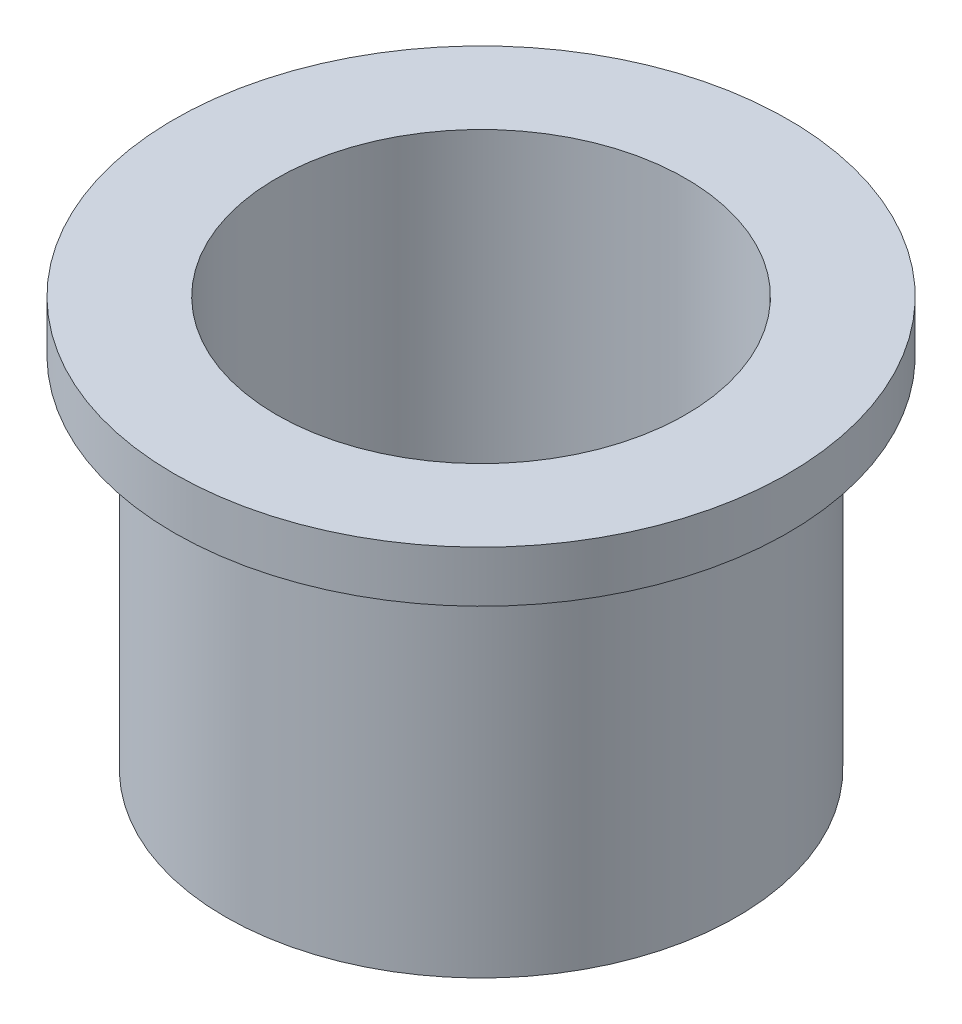
ISO-10303-21;
HEADER;
FILE_DESCRIPTION(('STEP AP214'),'2;1');
FILE_NAME('part.step','',(''),(''),'','','');
FILE_SCHEMA(('AUTOMOTIVE_DESIGN { 1 0 10303 214 1 1 1 1 }'));
ENDSEC;
DATA;
#1=APPLICATION_CONTEXT('core data for automotive mechanical design processes');
#2=APPLICATION_PROTOCOL_DEFINITION('international standard','automotive_design',2000,#1);
#3=PRODUCT_CONTEXT('',#1,'mechanical');
#4=PRODUCT('Part','Part','',(#3));
#5=PRODUCT_RELATED_PRODUCT_CATEGORY('part','',(#4));
#6=PRODUCT_DEFINITION_FORMATION('','',#4);
#7=PRODUCT_DEFINITION_CONTEXT('part definition',#1,'design');
#8=PRODUCT_DEFINITION('design','',#6,#7);
#9=PRODUCT_DEFINITION_SHAPE('','',#8);
#10=(LENGTH_UNIT() NAMED_UNIT(*) SI_UNIT(.MILLI.,.METRE.));
#11=(NAMED_UNIT(*) PLANE_ANGLE_UNIT() SI_UNIT($,.RADIAN.));
#12=(NAMED_UNIT(*) SI_UNIT($,.STERADIAN.) SOLID_ANGLE_UNIT());
#13=UNCERTAINTY_MEASURE_WITH_UNIT(LENGTH_MEASURE(1.E-05),#10,'distance_accuracy_value','');
#14=(GEOMETRIC_REPRESENTATION_CONTEXT(3) GLOBAL_UNCERTAINTY_ASSIGNED_CONTEXT((#13)) GLOBAL_UNIT_ASSIGNED_CONTEXT((#10,
#11,#12)) REPRESENTATION_CONTEXT('',''));
#15=CARTESIAN_POINT('',(0.,0.,0.));
#16=DIRECTION('',(0.,0.,1.));
#17=DIRECTION('',(1.,0.,0.));
#18=AXIS2_PLACEMENT_3D('',#15,#16,#17);
#19=CARTESIAN_POINT('',(0.,12.7,0.));
#20=DIRECTION('',(0.,-1.,0.));
#21=DIRECTION('',(0.,0.,-1.));
#22=AXIS2_PLACEMENT_3D('',#19,#20,#21);
#23=CYLINDRICAL_SURFACE('',#22,7.9375);
#24=CARTESIAN_POINT('',(0.,0.,0.));
#25=DIRECTION('',(0.,1.,0.));
#26=DIRECTION('',(0.,0.,1.));
#27=AXIS2_PLACEMENT_3D('',#24,#25,#26);
#28=CIRCLE('',#27,7.9375);
#29=CARTESIAN_POINT('',(0.,0.,7.9375));
#30=VERTEX_POINT('',#29);
#31=EDGE_CURVE('E34',#30,#30,#28,.T.);
#32=ORIENTED_EDGE('',*,*,#31,.T.);
#33=EDGE_LOOP('',(#32));
#34=FACE_BOUND('',#33,.T.);
#35=CARTESIAN_POINT('',(0.,11.1125,0.));
#36=DIRECTION('',(0.,1.,0.));
#37=DIRECTION('',(0.,0.,1.));
#38=AXIS2_PLACEMENT_3D('',#35,#36,#37);
#39=CIRCLE('',#38,7.9375);
#40=CARTESIAN_POINT('',(0.,11.1125,7.9375));
#41=VERTEX_POINT('',#40);
#42=EDGE_CURVE('E10',#41,#41,#39,.T.);
#43=ORIENTED_EDGE('',*,*,#42,.F.);
#44=EDGE_LOOP('',(#43));
#45=FACE_BOUND('',#44,.T.);
#46=ADVANCED_FACE('F31',(#34,#45),#23,.T.);
#47=CARTESIAN_POINT('',(0.,12.7,0.));
#48=DIRECTION('',(0.,1.,0.));
#49=DIRECTION('',(0.,0.,1.));
#50=AXIS2_PLACEMENT_3D('',#47,#48,#49);
#51=PLANE('',#50);
#52=CARTESIAN_POINT('',(0.,12.7,0.));
#53=DIRECTION('',(0.,1.,0.));
#54=DIRECTION('',(0.,0.,1.));
#55=AXIS2_PLACEMENT_3D('',#52,#53,#54);
#56=CIRCLE('',#55,6.35);
#57=CARTESIAN_POINT('',(0.,12.7,6.35));
#58=VERTEX_POINT('',#57);
#59=EDGE_CURVE('E42',#58,#58,#56,.T.);
#60=ORIENTED_EDGE('',*,*,#59,.F.);
#61=EDGE_LOOP('',(#60));
#62=FACE_BOUND('',#61,.T.);
#63=CARTESIAN_POINT('',(0.,12.7,0.));
#64=DIRECTION('',(0.,1.,0.));
#65=DIRECTION('',(0.,0.,1.));
#66=AXIS2_PLACEMENT_3D('',#63,#64,#65);
#67=CIRCLE('',#66,9.525);
#68=CARTESIAN_POINT('',(0.,12.7,9.525));
#69=VERTEX_POINT('',#68);
#70=EDGE_CURVE('E45',#69,#69,#67,.T.);
#71=ORIENTED_EDGE('',*,*,#70,.T.);
#72=EDGE_LOOP('',(#71));
#73=FACE_BOUND('',#72,.T.);
#74=ADVANCED_FACE('F59',(#62,#73),#51,.T.);
#75=CARTESIAN_POINT('',(0.,0.,0.));
#76=DIRECTION('',(0.,1.,0.));
#77=DIRECTION('',(0.,0.,1.));
#78=AXIS2_PLACEMENT_3D('',#75,#76,#77);
#79=PLANE('',#78);
#80=ORIENTED_EDGE('',*,*,#31,.F.);
#81=EDGE_LOOP('',(#80));
#82=FACE_BOUND('',#81,.T.);
#83=CARTESIAN_POINT('',(0.,0.,0.));
#84=DIRECTION('',(0.,1.,0.));
#85=DIRECTION('',(0.,0.,1.));
#86=AXIS2_PLACEMENT_3D('',#83,#84,#85);
#87=CIRCLE('',#86,6.35);
#88=CARTESIAN_POINT('',(0.,0.,6.35));
#89=VERTEX_POINT('',#88);
#90=EDGE_CURVE('E48',#89,#89,#87,.T.);
#91=ORIENTED_EDGE('',*,*,#90,.T.);
#92=EDGE_LOOP('',(#91));
#93=FACE_BOUND('',#92,.T.);
#94=ADVANCED_FACE('F77',(#82,#93),#79,.F.);
#95=CARTESIAN_POINT('',(0.,12.7,0.));
#96=DIRECTION('',(0.,-1.,0.));
#97=DIRECTION('',(0.,0.,-1.));
#98=AXIS2_PLACEMENT_3D('',#95,#96,#97);
#99=CYLINDRICAL_SURFACE('',#98,6.35);
#100=ORIENTED_EDGE('',*,*,#59,.T.);
#101=EDGE_LOOP('',(#100));
#102=FACE_BOUND('',#101,.T.);
#103=ORIENTED_EDGE('',*,*,#90,.F.);
#104=EDGE_LOOP('',(#103));
#105=FACE_BOUND('',#104,.T.);
#106=ADVANCED_FACE('F68',(#102,#105),#99,.F.);
#107=CARTESIAN_POINT('',(0.,11.1125,0.));
#108=DIRECTION('',(0.,1.,0.));
#109=DIRECTION('',(0.,0.,1.));
#110=AXIS2_PLACEMENT_3D('',#107,#108,#109);
#111=PLANE('',#110);
#112=CARTESIAN_POINT('',(0.,11.1125,0.));
#113=DIRECTION('',(0.,1.,0.));
#114=DIRECTION('',(0.,0.,1.));
#115=AXIS2_PLACEMENT_3D('',#112,#113,#114);
#116=CIRCLE('',#115,9.525);
#117=CARTESIAN_POINT('',(0.,11.1125,9.525));
#118=VERTEX_POINT('',#117);
#119=EDGE_CURVE('E50',#118,#118,#116,.T.);
#120=ORIENTED_EDGE('',*,*,#119,.F.);
#121=EDGE_LOOP('',(#120));
#122=FACE_BOUND('',#121,.T.);
#123=ORIENTED_EDGE('',*,*,#42,.T.);
#124=EDGE_LOOP('',(#123));
#125=FACE_BOUND('',#124,.T.);
#126=ADVANCED_FACE('F63',(#122,#125),#111,.F.);
#127=CARTESIAN_POINT('',(0.,11.1125,0.));
#128=DIRECTION('',(0.,1.,0.));
#129=DIRECTION('',(0.,0.,1.));
#130=AXIS2_PLACEMENT_3D('',#127,#128,#129);
#131=CYLINDRICAL_SURFACE('',#130,9.525);
#132=ORIENTED_EDGE('',*,*,#119,.T.);
#133=EDGE_LOOP('',(#132));
#134=FACE_BOUND('',#133,.T.);
#135=ORIENTED_EDGE('',*,*,#70,.F.);
#136=EDGE_LOOP('',(#135));
#137=FACE_BOUND('',#136,.T.);
#138=ADVANCED_FACE('F61',(#134,#137),#131,.T.);
#139=CLOSED_SHELL('',(#46,#74,#94,#106,#126,#138));
#140=MANIFOLD_SOLID_BREP('B2',#139);
#141=ADVANCED_BREP_SHAPE_REPRESENTATION('',(#18,#140),#14);
#142=SHAPE_DEFINITION_REPRESENTATION(#9,#141);
ENDSEC;
END-ISO-10303-21;
